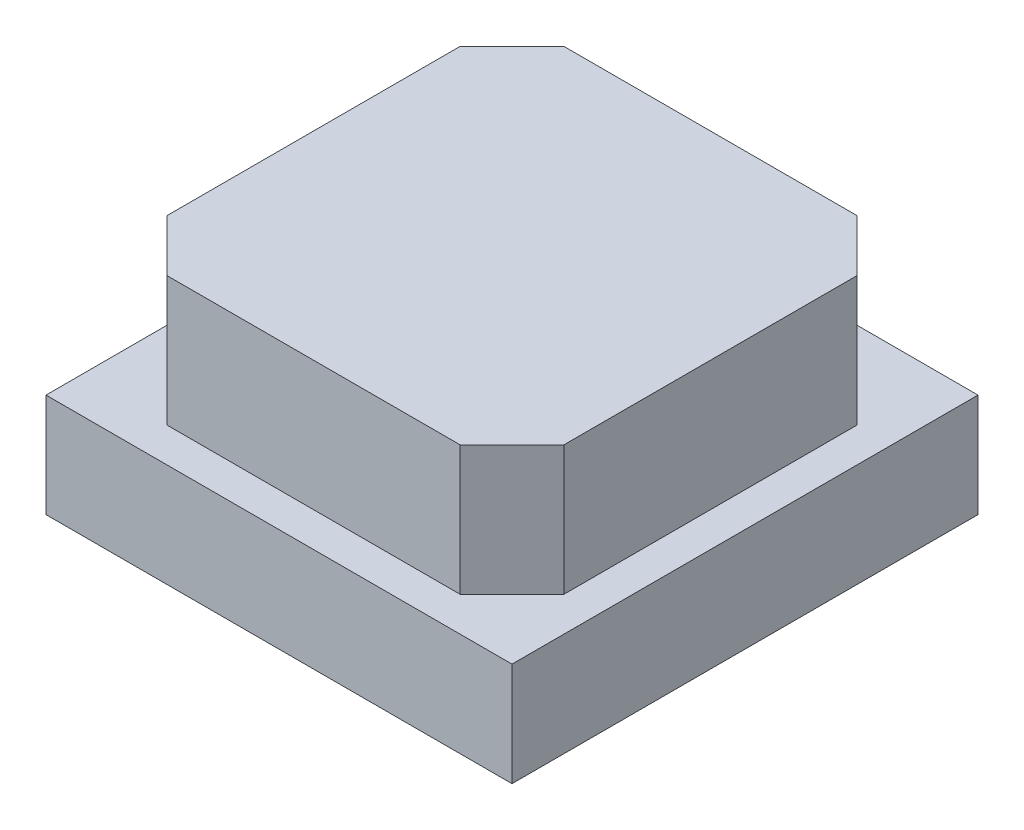
ISO-10303-21;
HEADER;
FILE_DESCRIPTION(('STEP AP214'),'2;1');
FILE_NAME('part.step','',(''),(''),'','','');
FILE_SCHEMA(('AUTOMOTIVE_DESIGN { 1 0 10303 214 1 1 1 1 }'));
ENDSEC;
DATA;
#1=APPLICATION_CONTEXT('core data for automotive mechanical design processes');
#2=APPLICATION_PROTOCOL_DEFINITION('international standard','automotive_design',2000,#1);
#3=PRODUCT_CONTEXT('',#1,'mechanical');
#4=PRODUCT('Part','Part','',(#3));
#5=PRODUCT_RELATED_PRODUCT_CATEGORY('part','',(#4));
#6=PRODUCT_DEFINITION_FORMATION('','',#4);
#7=PRODUCT_DEFINITION_CONTEXT('part definition',#1,'design');
#8=PRODUCT_DEFINITION('design','',#6,#7);
#9=PRODUCT_DEFINITION_SHAPE('','',#8);
#10=(LENGTH_UNIT() NAMED_UNIT(*) SI_UNIT(.MILLI.,.METRE.));
#11=(NAMED_UNIT(*) PLANE_ANGLE_UNIT() SI_UNIT($,.RADIAN.));
#12=(NAMED_UNIT(*) SI_UNIT($,.STERADIAN.) SOLID_ANGLE_UNIT());
#13=UNCERTAINTY_MEASURE_WITH_UNIT(LENGTH_MEASURE(1.E-05),#10,'distance_accuracy_value','');
#14=(GEOMETRIC_REPRESENTATION_CONTEXT(3) GLOBAL_UNCERTAINTY_ASSIGNED_CONTEXT((#13)) GLOBAL_UNIT_ASSIGNED_CONTEXT((#10,
#11,#12)) REPRESENTATION_CONTEXT('',''));
#15=CARTESIAN_POINT('',(0.,0.,0.));
#16=DIRECTION('',(0.,0.,1.));
#17=DIRECTION('',(1.,0.,0.));
#18=AXIS2_PLACEMENT_3D('',#15,#16,#17);
#19=CARTESIAN_POINT('',(0.,2.7,0.));
#20=DIRECTION('',(0.,1.,0.));
#21=DIRECTION('',(0.,0.,1.));
#22=AXIS2_PLACEMENT_3D('',#19,#20,#21);
#23=PLANE('',#22);
#24=DIRECTION('',(0.707106781186547,0.,0.707106781186547));
#25=VECTOR('',#24,1.);
#26=CARTESIAN_POINT('',(-2.3,2.7,1.7));
#27=LINE('',#26,#25);
#28=CARTESIAN_POINT('',(-2.3,2.7,1.7));
#29=VERTEX_POINT('',#28);
#30=CARTESIAN_POINT('',(-1.7,2.7,2.3));
#31=VERTEX_POINT('',#30);
#32=EDGE_CURVE('E19',#29,#31,#27,.T.);
#33=ORIENTED_EDGE('',*,*,#32,.T.);
#34=DIRECTION('',(1.,0.,0.));
#35=VECTOR('',#34,1.);
#36=CARTESIAN_POINT('',(-2.3,2.7,2.3));
#37=LINE('',#36,#35);
#38=CARTESIAN_POINT('',(1.7,2.7,2.3));
#39=VERTEX_POINT('',#38);
#40=EDGE_CURVE('E145',#39,#31,#37,.F.);
#41=ORIENTED_EDGE('',*,*,#40,.F.);
#42=DIRECTION('',(0.707106781186548,0.,-0.707106781186548));
#43=VECTOR('',#42,1.);
#44=CARTESIAN_POINT('',(2.,2.7,2.));
#45=LINE('',#44,#43);
#46=CARTESIAN_POINT('',(2.3,2.7,1.7));
#47=VERTEX_POINT('',#46);
#48=EDGE_CURVE('E137',#47,#39,#45,.F.);
#49=ORIENTED_EDGE('',*,*,#48,.F.);
#50=DIRECTION('',(0.,0.,-1.));
#51=VECTOR('',#50,1.);
#52=CARTESIAN_POINT('',(2.3,2.7,2.3));
#53=LINE('',#52,#51);
#54=CARTESIAN_POINT('',(2.3,2.7,-1.7));
#55=VERTEX_POINT('',#54);
#56=EDGE_CURVE('E135',#55,#47,#53,.F.);
#57=ORIENTED_EDGE('',*,*,#56,.F.);
#58=DIRECTION('',(-0.707106781186548,0.,-0.707106781186548));
#59=VECTOR('',#58,1.);
#60=CARTESIAN_POINT('',(2.,2.7,-2.));
#61=LINE('',#60,#59);
#62=CARTESIAN_POINT('',(1.7,2.7,-2.3));
#63=VERTEX_POINT('',#62);
#64=EDGE_CURVE('E127',#63,#55,#61,.F.);
#65=ORIENTED_EDGE('',*,*,#64,.F.);
#66=DIRECTION('',(-1.,0.,0.));
#67=VECTOR('',#66,1.);
#68=CARTESIAN_POINT('',(2.3,2.7,-2.3));
#69=LINE('',#68,#67);
#70=CARTESIAN_POINT('',(-1.7,2.7,-2.3));
#71=VERTEX_POINT('',#70);
#72=EDGE_CURVE('E122',#71,#63,#69,.F.);
#73=ORIENTED_EDGE('',*,*,#72,.F.);
#74=DIRECTION('',(-0.707106781186548,0.,0.707106781186548));
#75=VECTOR('',#74,1.);
#76=CARTESIAN_POINT('',(-2.,2.7,-2.));
#77=LINE('',#76,#75);
#78=CARTESIAN_POINT('',(-2.3,2.7,-1.7));
#79=VERTEX_POINT('',#78);
#80=EDGE_CURVE('E102',#79,#71,#77,.F.);
#81=ORIENTED_EDGE('',*,*,#80,.F.);
#82=DIRECTION('',(0.,0.,1.));
#83=VECTOR('',#82,1.);
#84=CARTESIAN_POINT('',(-2.3,2.7,-2.3));
#85=LINE('',#84,#83);
#86=EDGE_CURVE('E109',#29,#79,#85,.F.);
#87=ORIENTED_EDGE('',*,*,#86,.F.);
#88=EDGE_LOOP('',(#33,#41,#49,#57,#65,#73,#81,#87));
#89=FACE_BOUND('',#88,.T.);
#90=ADVANCED_FACE('F16',(#89),#23,.T.);
#91=CARTESIAN_POINT('',(-2.3,1.2,-2.3));
#92=DIRECTION('',(-1.,0.,0.));
#93=DIRECTION('',(0.,0.,1.));
#94=AXIS2_PLACEMENT_3D('',#91,#92,#93);
#95=PLANE('',#94);
#96=DIRECTION('',(0.,1.,0.));
#97=VECTOR('',#96,1.);
#98=CARTESIAN_POINT('',(-2.3,1.2,1.7));
#99=LINE('',#98,#97);
#100=CARTESIAN_POINT('',(-2.3,1.2,1.7));
#101=VERTEX_POINT('',#100);
#102=EDGE_CURVE('E114',#29,#101,#99,.F.);
#103=ORIENTED_EDGE('',*,*,#102,.F.);
#104=ORIENTED_EDGE('',*,*,#86,.T.);
#105=DIRECTION('',(0.,1.,0.));
#106=VECTOR('',#105,1.);
#107=CARTESIAN_POINT('',(-2.3,1.2,-1.7));
#108=LINE('',#107,#106);
#109=CARTESIAN_POINT('',(-2.3,1.2,-1.7));
#110=VERTEX_POINT('',#109);
#111=EDGE_CURVE('E112',#110,#79,#108,.T.);
#112=ORIENTED_EDGE('',*,*,#111,.F.);
#113=DIRECTION('',(0.,0.,1.));
#114=VECTOR('',#113,1.);
#115=CARTESIAN_POINT('',(-2.3,1.2,0.));
#116=LINE('',#115,#114);
#117=EDGE_CURVE('E152',#101,#110,#116,.F.);
#118=ORIENTED_EDGE('',*,*,#117,.F.);
#119=EDGE_LOOP('',(#103,#104,#112,#118));
#120=FACE_BOUND('',#119,.T.);
#121=ADVANCED_FACE('F110',(#120),#95,.T.);
#122=CARTESIAN_POINT('',(-2.,1.2,-2.));
#123=DIRECTION('',(-0.707106781186548,0.,-0.707106781186548));
#124=DIRECTION('',(-0.707106781186548,0.,0.707106781186548));
#125=AXIS2_PLACEMENT_3D('',#122,#123,#124);
#126=PLANE('',#125);
#127=DIRECTION('',(0.707106781186547,0.,-0.707106781186547));
#128=VECTOR('',#127,1.);
#129=CARTESIAN_POINT('',(-2.3,1.2,-1.7));
#130=LINE('',#129,#128);
#131=CARTESIAN_POINT('',(-1.7,1.2,-2.3));
#132=VERTEX_POINT('',#131);
#133=EDGE_CURVE('E117',#110,#132,#130,.T.);
#134=ORIENTED_EDGE('',*,*,#133,.F.);
#135=ORIENTED_EDGE('',*,*,#111,.T.);
#136=ORIENTED_EDGE('',*,*,#80,.T.);
#137=DIRECTION('',(0.,1.,0.));
#138=VECTOR('',#137,1.);
#139=CARTESIAN_POINT('',(-1.7,1.2,-2.3));
#140=LINE('',#139,#138);
#141=EDGE_CURVE('E118',#132,#71,#140,.T.);
#142=ORIENTED_EDGE('',*,*,#141,.F.);
#143=EDGE_LOOP('',(#134,#135,#136,#142));
#144=FACE_BOUND('',#143,.T.);
#145=ADVANCED_FACE('F116',(#144),#126,.T.);
#146=CARTESIAN_POINT('',(2.3,1.2,-2.3));
#147=DIRECTION('',(0.,0.,-1.));
#148=DIRECTION('',(-1.,0.,0.));
#149=AXIS2_PLACEMENT_3D('',#146,#147,#148);
#150=PLANE('',#149);
#151=ORIENTED_EDGE('',*,*,#141,.T.);
#152=ORIENTED_EDGE('',*,*,#72,.T.);
#153=DIRECTION('',(0.,1.,0.));
#154=VECTOR('',#153,1.);
#155=CARTESIAN_POINT('',(1.7,1.2,-2.3));
#156=LINE('',#155,#154);
#157=CARTESIAN_POINT('',(1.7,1.2,-2.3));
#158=VERTEX_POINT('',#157);
#159=EDGE_CURVE('E129',#158,#63,#156,.T.);
#160=ORIENTED_EDGE('',*,*,#159,.F.);
#161=DIRECTION('',(1.,0.,0.));
#162=VECTOR('',#161,1.);
#163=CARTESIAN_POINT('',(0.,1.2,-2.3));
#164=LINE('',#163,#162);
#165=EDGE_CURVE('E155',#132,#158,#164,.T.);
#166=ORIENTED_EDGE('',*,*,#165,.F.);
#167=EDGE_LOOP('',(#151,#152,#160,#166));
#168=FACE_BOUND('',#167,.T.);
#169=ADVANCED_FACE('F246',(#168),#150,.T.);
#170=CARTESIAN_POINT('',(2.,1.2,-2.));
#171=DIRECTION('',(0.707106781186548,0.,-0.707106781186548));
#172=DIRECTION('',(-0.707106781186548,0.,-0.707106781186548));
#173=AXIS2_PLACEMENT_3D('',#170,#171,#172);
#174=PLANE('',#173);
#175=DIRECTION('',(0.707106781186547,0.,0.707106781186547));
#176=VECTOR('',#175,1.);
#177=CARTESIAN_POINT('',(1.7,1.2,-2.3));
#178=LINE('',#177,#176);
#179=CARTESIAN_POINT('',(2.3,1.2,-1.7));
#180=VERTEX_POINT('',#179);
#181=EDGE_CURVE('E157',#158,#180,#178,.T.);
#182=ORIENTED_EDGE('',*,*,#181,.F.);
#183=ORIENTED_EDGE('',*,*,#159,.T.);
#184=ORIENTED_EDGE('',*,*,#64,.T.);
#185=DIRECTION('',(0.,1.,0.));
#186=VECTOR('',#185,1.);
#187=CARTESIAN_POINT('',(2.3,1.2,-1.7));
#188=LINE('',#187,#186);
#189=EDGE_CURVE('E132',#180,#55,#188,.T.);
#190=ORIENTED_EDGE('',*,*,#189,.F.);
#191=EDGE_LOOP('',(#182,#183,#184,#190));
#192=FACE_BOUND('',#191,.T.);
#193=ADVANCED_FACE('F242',(#192),#174,.T.);
#194=CARTESIAN_POINT('',(2.3,1.2,2.3));
#195=DIRECTION('',(1.,0.,0.));
#196=DIRECTION('',(0.,0.,-1.));
#197=AXIS2_PLACEMENT_3D('',#194,#195,#196);
#198=PLANE('',#197);
#199=ORIENTED_EDGE('',*,*,#189,.T.);
#200=ORIENTED_EDGE('',*,*,#56,.T.);
#201=DIRECTION('',(0.,1.,0.));
#202=VECTOR('',#201,1.);
#203=CARTESIAN_POINT('',(2.3,1.2,1.7));
#204=LINE('',#203,#202);
#205=CARTESIAN_POINT('',(2.3,1.2,1.7));
#206=VERTEX_POINT('',#205);
#207=EDGE_CURVE('E139',#206,#47,#204,.T.);
#208=ORIENTED_EDGE('',*,*,#207,.F.);
#209=DIRECTION('',(0.,0.,1.));
#210=VECTOR('',#209,1.);
#211=CARTESIAN_POINT('',(2.3,1.2,0.));
#212=LINE('',#211,#210);
#213=EDGE_CURVE('E159',#180,#206,#212,.T.);
#214=ORIENTED_EDGE('',*,*,#213,.F.);
#215=EDGE_LOOP('',(#199,#200,#208,#214));
#216=FACE_BOUND('',#215,.T.);
#217=ADVANCED_FACE('F238',(#216),#198,.T.);
#218=CARTESIAN_POINT('',(2.,1.2,2.));
#219=DIRECTION('',(0.707106781186548,0.,0.707106781186548));
#220=DIRECTION('',(0.707106781186548,0.,-0.707106781186548));
#221=AXIS2_PLACEMENT_3D('',#218,#219,#220);
#222=PLANE('',#221);
#223=DIRECTION('',(-0.707106781186547,0.,0.707106781186547));
#224=VECTOR('',#223,1.);
#225=CARTESIAN_POINT('',(2.3,1.2,1.7));
#226=LINE('',#225,#224);
#227=CARTESIAN_POINT('',(1.7,1.2,2.3));
#228=VERTEX_POINT('',#227);
#229=EDGE_CURVE('E161',#206,#228,#226,.T.);
#230=ORIENTED_EDGE('',*,*,#229,.F.);
#231=ORIENTED_EDGE('',*,*,#207,.T.);
#232=ORIENTED_EDGE('',*,*,#48,.T.);
#233=DIRECTION('',(0.,1.,0.));
#234=VECTOR('',#233,1.);
#235=CARTESIAN_POINT('',(1.7,1.2,2.3));
#236=LINE('',#235,#234);
#237=EDGE_CURVE('E142',#228,#39,#236,.T.);
#238=ORIENTED_EDGE('',*,*,#237,.F.);
#239=EDGE_LOOP('',(#230,#231,#232,#238));
#240=FACE_BOUND('',#239,.T.);
#241=ADVANCED_FACE('F234',(#240),#222,.T.);
#242=CARTESIAN_POINT('',(-2.3,1.2,2.3));
#243=DIRECTION('',(0.,0.,1.));
#244=DIRECTION('',(1.,0.,0.));
#245=AXIS2_PLACEMENT_3D('',#242,#243,#244);
#246=PLANE('',#245);
#247=DIRECTION('',(0.,1.,0.));
#248=VECTOR('',#247,1.);
#249=CARTESIAN_POINT('',(-1.7,1.2,2.3));
#250=LINE('',#249,#248);
#251=CARTESIAN_POINT('',(-1.7,1.2,2.3));
#252=VERTEX_POINT('',#251);
#253=EDGE_CURVE('E149',#252,#31,#250,.T.);
#254=ORIENTED_EDGE('',*,*,#253,.F.);
#255=DIRECTION('',(1.,0.,0.));
#256=VECTOR('',#255,1.);
#257=CARTESIAN_POINT('',(0.,1.2,2.3));
#258=LINE('',#257,#256);
#259=EDGE_CURVE('E163',#228,#252,#258,.F.);
#260=ORIENTED_EDGE('',*,*,#259,.F.);
#261=ORIENTED_EDGE('',*,*,#237,.T.);
#262=ORIENTED_EDGE('',*,*,#40,.T.);
#263=EDGE_LOOP('',(#254,#260,#261,#262));
#264=FACE_BOUND('',#263,.T.);
#265=ADVANCED_FACE('F230',(#264),#246,.T.);
#266=CARTESIAN_POINT('',(-2.,1.2,2.));
#267=DIRECTION('',(-0.707106781186548,0.,0.707106781186548));
#268=DIRECTION('',(0.707106781186548,0.,0.707106781186548));
#269=AXIS2_PLACEMENT_3D('',#266,#267,#268);
#270=PLANE('',#269);
#271=DIRECTION('',(-0.707106781186547,0.,-0.707106781186547));
#272=VECTOR('',#271,1.);
#273=CARTESIAN_POINT('',(-1.7,1.2,2.3));
#274=LINE('',#273,#272);
#275=EDGE_CURVE('E165',#252,#101,#274,.T.);
#276=ORIENTED_EDGE('',*,*,#275,.F.);
#277=ORIENTED_EDGE('',*,*,#253,.T.);
#278=ORIENTED_EDGE('',*,*,#32,.F.);
#279=ORIENTED_EDGE('',*,*,#102,.T.);
#280=EDGE_LOOP('',(#276,#277,#278,#279));
#281=FACE_BOUND('',#280,.T.);
#282=ADVANCED_FACE('F226',(#281),#270,.T.);
#283=CARTESIAN_POINT('',(0.,1.2,0.));
#284=DIRECTION('',(0.,1.,0.));
#285=DIRECTION('',(0.,0.,1.));
#286=AXIS2_PLACEMENT_3D('',#283,#284,#285);
#287=PLANE('',#286);
#288=ORIENTED_EDGE('',*,*,#259,.T.);
#289=ORIENTED_EDGE('',*,*,#275,.T.);
#290=ORIENTED_EDGE('',*,*,#117,.T.);
#291=ORIENTED_EDGE('',*,*,#133,.T.);
#292=ORIENTED_EDGE('',*,*,#165,.T.);
#293=ORIENTED_EDGE('',*,*,#181,.T.);
#294=ORIENTED_EDGE('',*,*,#213,.T.);
#295=ORIENTED_EDGE('',*,*,#229,.T.);
#296=EDGE_LOOP('',(#288,#289,#290,#291,#292,#293,#294,#295));
#297=FACE_BOUND('',#296,.T.);
#298=DIRECTION('',(-1.,0.,0.));
#299=VECTOR('',#298,1.);
#300=CARTESIAN_POINT('',(2.7,1.2,-2.7));
#301=LINE('',#300,#299);
#302=CARTESIAN_POINT('',(-2.7,1.2,-2.7));
#303=VERTEX_POINT('',#302);
#304=CARTESIAN_POINT('',(2.7,1.2,-2.7));
#305=VERTEX_POINT('',#304);
#306=EDGE_CURVE('E170',#303,#305,#301,.F.);
#307=ORIENTED_EDGE('',*,*,#306,.F.);
#308=DIRECTION('',(0.,0.,1.));
#309=VECTOR('',#308,1.);
#310=CARTESIAN_POINT('',(-2.7,1.2,-2.7));
#311=LINE('',#310,#309);
#312=CARTESIAN_POINT('',(-2.7,1.2,2.7));
#313=VERTEX_POINT('',#312);
#314=EDGE_CURVE('E174',#313,#303,#311,.F.);
#315=ORIENTED_EDGE('',*,*,#314,.F.);
#316=DIRECTION('',(1.,0.,0.));
#317=VECTOR('',#316,1.);
#318=CARTESIAN_POINT('',(-2.7,1.2,2.7));
#319=LINE('',#318,#317);
#320=CARTESIAN_POINT('',(2.7,1.2,2.7));
#321=VERTEX_POINT('',#320);
#322=EDGE_CURVE('E181',#321,#313,#319,.F.);
#323=ORIENTED_EDGE('',*,*,#322,.F.);
#324=DIRECTION('',(0.,0.,-1.));
#325=VECTOR('',#324,1.);
#326=CARTESIAN_POINT('',(2.7,1.2,2.7));
#327=LINE('',#326,#325);
#328=EDGE_CURVE('E168',#305,#321,#327,.F.);
#329=ORIENTED_EDGE('',*,*,#328,.F.);
#330=EDGE_LOOP('',(#307,#315,#323,#329));
#331=FACE_BOUND('',#330,.T.);
#332=ADVANCED_FACE('F223',(#297,#331),#287,.T.);
#333=CARTESIAN_POINT('',(2.7,0.,2.7));
#334=DIRECTION('',(1.,0.,0.));
#335=DIRECTION('',(0.,0.,-1.));
#336=AXIS2_PLACEMENT_3D('',#333,#334,#335);
#337=PLANE('',#336);
#338=ORIENTED_EDGE('',*,*,#328,.T.);
#339=DIRECTION('',(0.,1.,0.));
#340=VECTOR('',#339,1.);
#341=CARTESIAN_POINT('',(2.7,0.,2.7));
#342=LINE('',#341,#340);
#343=CARTESIAN_POINT('',(2.7,0.,2.7));
#344=VERTEX_POINT('',#343);
#345=EDGE_CURVE('E178',#344,#321,#342,.T.);
#346=ORIENTED_EDGE('',*,*,#345,.F.);
#347=DIRECTION('',(0.,0.,1.));
#348=VECTOR('',#347,1.);
#349=CARTESIAN_POINT('',(2.7,0.,0.));
#350=LINE('',#349,#348);
#351=CARTESIAN_POINT('',(2.7,0.,-2.7));
#352=VERTEX_POINT('',#351);
#353=EDGE_CURVE('E184',#344,#352,#350,.F.);
#354=ORIENTED_EDGE('',*,*,#353,.T.);
#355=DIRECTION('',(0.,1.,0.));
#356=VECTOR('',#355,1.);
#357=CARTESIAN_POINT('',(2.7,0.,-2.7));
#358=LINE('',#357,#356);
#359=EDGE_CURVE('E172',#305,#352,#358,.F.);
#360=ORIENTED_EDGE('',*,*,#359,.F.);
#361=EDGE_LOOP('',(#338,#346,#354,#360));
#362=FACE_BOUND('',#361,.T.);
#363=ADVANCED_FACE('F204',(#362),#337,.T.);
#364=CARTESIAN_POINT('',(2.7,0.,-2.7));
#365=DIRECTION('',(0.,0.,-1.));
#366=DIRECTION('',(-1.,0.,0.));
#367=AXIS2_PLACEMENT_3D('',#364,#365,#366);
#368=PLANE('',#367);
#369=ORIENTED_EDGE('',*,*,#306,.T.);
#370=ORIENTED_EDGE('',*,*,#359,.T.);
#371=DIRECTION('',(1.,0.,0.));
#372=VECTOR('',#371,1.);
#373=CARTESIAN_POINT('',(0.,0.,-2.7));
#374=LINE('',#373,#372);
#375=CARTESIAN_POINT('',(-2.7,0.,-2.7));
#376=VERTEX_POINT('',#375);
#377=EDGE_CURVE('E187',#352,#376,#374,.F.);
#378=ORIENTED_EDGE('',*,*,#377,.T.);
#379=DIRECTION('',(0.,1.,0.));
#380=VECTOR('',#379,1.);
#381=CARTESIAN_POINT('',(-2.7,0.,-2.7));
#382=LINE('',#381,#380);
#383=EDGE_CURVE('E176',#303,#376,#382,.F.);
#384=ORIENTED_EDGE('',*,*,#383,.F.);
#385=EDGE_LOOP('',(#369,#370,#378,#384));
#386=FACE_BOUND('',#385,.T.);
#387=ADVANCED_FACE('F199',(#386),#368,.T.);
#388=CARTESIAN_POINT('',(-2.7,0.,-2.7));
#389=DIRECTION('',(-1.,0.,0.));
#390=DIRECTION('',(0.,0.,1.));
#391=AXIS2_PLACEMENT_3D('',#388,#389,#390);
#392=PLANE('',#391);
#393=ORIENTED_EDGE('',*,*,#314,.T.);
#394=ORIENTED_EDGE('',*,*,#383,.T.);
#395=DIRECTION('',(0.,0.,1.));
#396=VECTOR('',#395,1.);
#397=CARTESIAN_POINT('',(-2.7,0.,0.));
#398=LINE('',#397,#396);
#399=CARTESIAN_POINT('',(-2.7,0.,2.7));
#400=VERTEX_POINT('',#399);
#401=EDGE_CURVE('E25',#376,#400,#398,.T.);
#402=ORIENTED_EDGE('',*,*,#401,.T.);
#403=DIRECTION('',(0.,1.,0.));
#404=VECTOR('',#403,1.);
#405=CARTESIAN_POINT('',(-2.7,0.,2.7));
#406=LINE('',#405,#404);
#407=EDGE_CURVE('E33',#313,#400,#406,.F.);
#408=ORIENTED_EDGE('',*,*,#407,.F.);
#409=EDGE_LOOP('',(#393,#394,#402,#408));
#410=FACE_BOUND('',#409,.T.);
#411=ADVANCED_FACE('F193',(#410),#392,.T.);
#412=CARTESIAN_POINT('',(-2.7,0.,2.7));
#413=DIRECTION('',(0.,0.,1.));
#414=DIRECTION('',(1.,0.,0.));
#415=AXIS2_PLACEMENT_3D('',#412,#413,#414);
#416=PLANE('',#415);
#417=ORIENTED_EDGE('',*,*,#322,.T.);
#418=ORIENTED_EDGE('',*,*,#407,.T.);
#419=DIRECTION('',(1.,0.,0.));
#420=VECTOR('',#419,1.);
#421=CARTESIAN_POINT('',(0.,0.,2.7));
#422=LINE('',#421,#420);
#423=EDGE_CURVE('E11',#400,#344,#422,.T.);
#424=ORIENTED_EDGE('',*,*,#423,.T.);
#425=ORIENTED_EDGE('',*,*,#345,.T.);
#426=EDGE_LOOP('',(#417,#418,#424,#425));
#427=FACE_BOUND('',#426,.T.);
#428=ADVANCED_FACE('F207',(#427),#416,.T.);
#429=CARTESIAN_POINT('',(0.,0.,0.));
#430=DIRECTION('',(0.,1.,0.));
#431=DIRECTION('',(0.,0.,1.));
#432=AXIS2_PLACEMENT_3D('',#429,#430,#431);
#433=PLANE('',#432);
#434=ORIENTED_EDGE('',*,*,#401,.F.);
#435=ORIENTED_EDGE('',*,*,#377,.F.);
#436=ORIENTED_EDGE('',*,*,#353,.F.);
#437=ORIENTED_EDGE('',*,*,#423,.F.);
#438=EDGE_LOOP('',(#434,#435,#436,#437));
#439=FACE_BOUND('',#438,.T.);
#440=ADVANCED_FACE('F197',(#439),#433,.F.);
#441=CLOSED_SHELL('',(#90,#121,#145,#169,#193,#217,#241,#265,#282,#332,#363,#387,#411,#428,#440));
#442=MANIFOLD_SOLID_BREP('B1',#441);
#443=ADVANCED_BREP_SHAPE_REPRESENTATION('',(#18,#442),#14);
#444=SHAPE_DEFINITION_REPRESENTATION(#9,#443);
ENDSEC;
END-ISO-10303-21;
